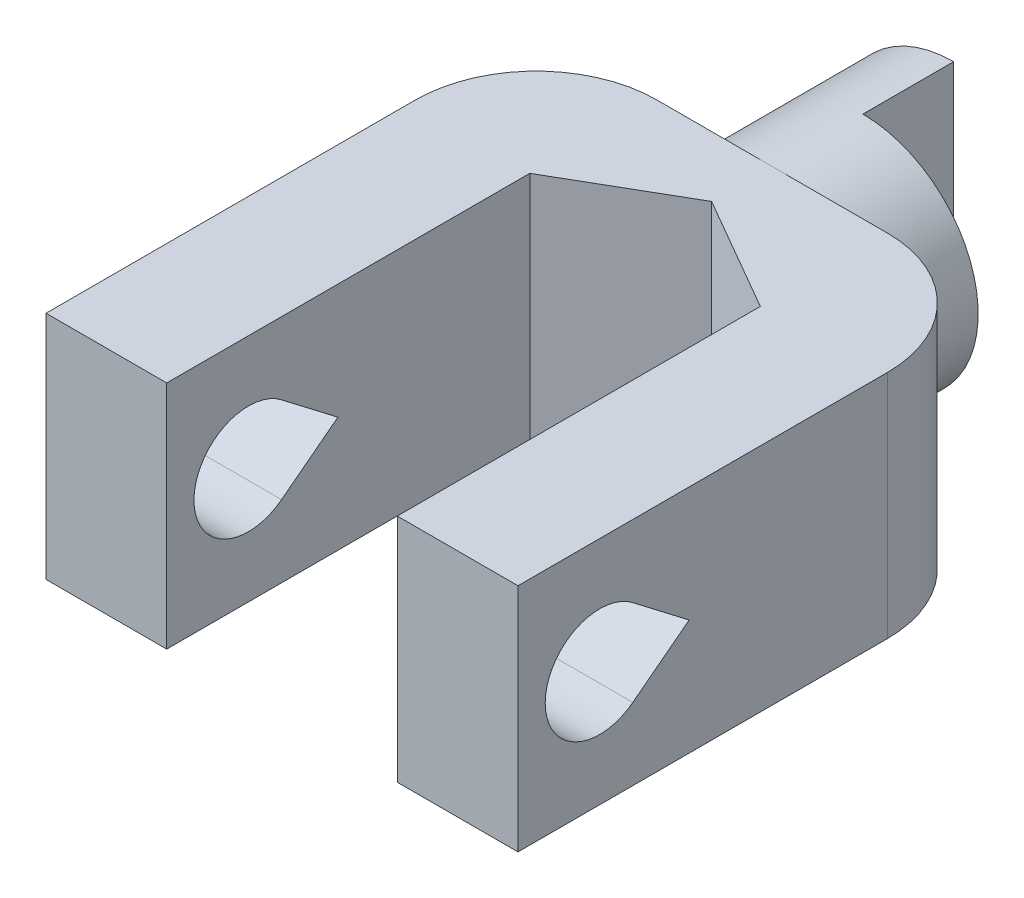
ISO-10303-21;
HEADER;
FILE_DESCRIPTION(('STEP AP214'),'2;1');
FILE_NAME('part.step','',(''),(''),'','','');
FILE_SCHEMA(('AUTOMOTIVE_DESIGN { 1 0 10303 214 1 1 1 1 }'));
ENDSEC;
DATA;
#1=APPLICATION_CONTEXT('core data for automotive mechanical design processes');
#2=APPLICATION_PROTOCOL_DEFINITION('international standard','automotive_design',2000,#1);
#3=PRODUCT_CONTEXT('',#1,'mechanical');
#4=PRODUCT('Part','Part','',(#3));
#5=PRODUCT_RELATED_PRODUCT_CATEGORY('part','',(#4));
#6=PRODUCT_DEFINITION_FORMATION('','',#4);
#7=PRODUCT_DEFINITION_CONTEXT('part definition',#1,'design');
#8=PRODUCT_DEFINITION('design','',#6,#7);
#9=PRODUCT_DEFINITION_SHAPE('','',#8);
#10=(LENGTH_UNIT() NAMED_UNIT(*) SI_UNIT(.MILLI.,.METRE.));
#11=(NAMED_UNIT(*) PLANE_ANGLE_UNIT() SI_UNIT($,.RADIAN.));
#12=(NAMED_UNIT(*) SI_UNIT($,.STERADIAN.) SOLID_ANGLE_UNIT());
#13=UNCERTAINTY_MEASURE_WITH_UNIT(LENGTH_MEASURE(1.E-05),#10,'distance_accuracy_value','');
#14=(GEOMETRIC_REPRESENTATION_CONTEXT(3) GLOBAL_UNCERTAINTY_ASSIGNED_CONTEXT((#13)) GLOBAL_UNIT_ASSIGNED_CONTEXT((#10,
#11,#12)) REPRESENTATION_CONTEXT('',''));
#15=CARTESIAN_POINT('',(0.,0.,0.));
#16=DIRECTION('',(0.,0.,1.));
#17=DIRECTION('',(1.,0.,0.));
#18=AXIS2_PLACEMENT_3D('',#15,#16,#17);
#19=CARTESIAN_POINT('',(-6.5,3.175,18.5));
#20=DIRECTION('',(0.,-1.,0.));
#21=DIRECTION('',(0.,0.,-1.));
#22=AXIS2_PLACEMENT_3D('',#19,#20,#21);
#23=PLANE('',#22);
#24=CARTESIAN_POINT('',(3.175,3.175,8.325));
#25=DIRECTION('',(0.,1.,0.));
#26=DIRECTION('',(0.,0.,1.));
#27=AXIS2_PLACEMENT_3D('',#24,#25,#26);
#28=CIRCLE('',#27,3.325);
#29=CARTESIAN_POINT('',(6.5,3.175,8.325));
#30=VERTEX_POINT('',#29);
#31=CARTESIAN_POINT('',(3.175,3.175,5.));
#32=VERTEX_POINT('',#31);
#33=EDGE_CURVE('E223',#30,#32,#28,.T.);
#34=ORIENTED_EDGE('',*,*,#33,.T.);
#35=DIRECTION('',(-1.,0.,0.));
#36=VECTOR('',#35,1.);
#37=CARTESIAN_POINT('',(-6.5,3.175,5.));
#38=LINE('',#37,#36);
#39=CARTESIAN_POINT('',(0.,3.175,5.));
#40=VERTEX_POINT('',#39);
#41=EDGE_CURVE('E302',#32,#40,#38,.T.);
#42=ORIENTED_EDGE('',*,*,#41,.T.);
#43=CARTESIAN_POINT('',(-3.175,3.175,5.));
#44=VERTEX_POINT('',#43);
#45=EDGE_CURVE('E286',#40,#44,#38,.T.);
#46=ORIENTED_EDGE('',*,*,#45,.T.);
#47=CARTESIAN_POINT('',(-3.175,3.175,8.325));
#48=DIRECTION('',(0.,-1.,0.));
#49=DIRECTION('',(0.,0.,1.));
#50=AXIS2_PLACEMENT_3D('',#47,#48,#49);
#51=CIRCLE('',#50,3.325);
#52=CARTESIAN_POINT('',(-6.5,3.175,8.325));
#53=VERTEX_POINT('',#52);
#54=EDGE_CURVE('E230',#53,#44,#51,.T.);
#55=ORIENTED_EDGE('',*,*,#54,.F.);
#56=DIRECTION('',(0.,0.,-1.));
#57=VECTOR('',#56,1.);
#58=CARTESIAN_POINT('',(-6.5,3.175,18.5));
#59=LINE('',#58,#57);
#60=CARTESIAN_POINT('',(-6.5,3.175,18.5));
#61=VERTEX_POINT('',#60);
#62=EDGE_CURVE('E312',#61,#53,#59,.T.);
#63=ORIENTED_EDGE('',*,*,#62,.F.);
#64=DIRECTION('',(-1.,0.,0.));
#65=VECTOR('',#64,1.);
#66=CARTESIAN_POINT('',(-6.5,3.175,18.5));
#67=LINE('',#66,#65);
#68=CARTESIAN_POINT('',(-3.175,3.175,18.5));
#69=VERTEX_POINT('',#68);
#70=EDGE_CURVE('E290',#69,#61,#67,.T.);
#71=ORIENTED_EDGE('',*,*,#70,.F.);
#72=DIRECTION('',(0.,0.,1.));
#73=VECTOR('',#72,1.);
#74=CARTESIAN_POINT('',(-3.175,3.175,18.5));
#75=LINE('',#74,#73);
#76=CARTESIAN_POINT('',(-3.175,3.175,8.5));
#77=VERTEX_POINT('',#76);
#78=EDGE_CURVE('E253',#77,#69,#75,.T.);
#79=ORIENTED_EDGE('',*,*,#78,.F.);
#80=DIRECTION('',(-0.866025403784438,0.,0.500000000000001));
#81=VECTOR('',#80,1.);
#82=CARTESIAN_POINT('',(-3.175,3.175,8.5));
#83=LINE('',#82,#81);
#84=CARTESIAN_POINT('',(0.,3.175,6.66691289532293));
#85=VERTEX_POINT('',#84);
#86=EDGE_CURVE('E250',#85,#77,#83,.T.);
#87=ORIENTED_EDGE('',*,*,#86,.F.);
#88=DIRECTION('',(-0.866025403784438,0.,-0.500000000000001));
#89=VECTOR('',#88,1.);
#90=CARTESIAN_POINT('',(0.,3.175,6.66691289532293));
#91=LINE('',#90,#89);
#92=CARTESIAN_POINT('',(3.175,3.175,8.5));
#93=VERTEX_POINT('',#92);
#94=EDGE_CURVE('E258',#93,#85,#91,.T.);
#95=ORIENTED_EDGE('',*,*,#94,.F.);
#96=DIRECTION('',(0.,0.,-1.));
#97=VECTOR('',#96,1.);
#98=CARTESIAN_POINT('',(3.175,3.175,8.5));
#99=LINE('',#98,#97);
#100=CARTESIAN_POINT('',(3.175,3.175,18.5));
#101=VERTEX_POINT('',#100);
#102=EDGE_CURVE('E255',#101,#93,#99,.T.);
#103=ORIENTED_EDGE('',*,*,#102,.F.);
#104=CARTESIAN_POINT('',(6.5,3.175,18.5));
#105=VERTEX_POINT('',#104);
#106=EDGE_CURVE('E292',#105,#101,#67,.T.);
#107=ORIENTED_EDGE('',*,*,#106,.F.);
#108=DIRECTION('',(0.,0.,-1.));
#109=VECTOR('',#108,1.);
#110=CARTESIAN_POINT('',(6.5,3.175,18.5));
#111=LINE('',#110,#109);
#112=EDGE_CURVE('E315',#105,#30,#111,.T.);
#113=ORIENTED_EDGE('',*,*,#112,.T.);
#114=EDGE_LOOP('',(#34,#42,#46,#55,#63,#71,#79,#87,#95,#103,#107,#113));
#115=FACE_BOUND('',#114,.T.);
#116=ADVANCED_FACE('F38',(#115),#23,.F.);
#117=CARTESIAN_POINT('',(-6.5,-3.175,18.5));
#118=DIRECTION('',(0.,1.,0.));
#119=DIRECTION('',(0.,0.,1.));
#120=AXIS2_PLACEMENT_3D('',#117,#118,#119);
#121=PLANE('',#120);
#122=CARTESIAN_POINT('',(3.175,-3.175,8.325));
#123=DIRECTION('',(0.,1.,0.));
#124=DIRECTION('',(0.,0.,1.));
#125=AXIS2_PLACEMENT_3D('',#122,#123,#124);
#126=CIRCLE('',#125,3.325);
#127=CARTESIAN_POINT('',(3.175,-3.175,5.));
#128=VERTEX_POINT('',#127);
#129=CARTESIAN_POINT('',(6.5,-3.175,8.325));
#130=VERTEX_POINT('',#129);
#131=EDGE_CURVE('E220',#128,#130,#126,.F.);
#132=ORIENTED_EDGE('',*,*,#131,.T.);
#133=DIRECTION('',(0.,0.,-1.));
#134=VECTOR('',#133,1.);
#135=CARTESIAN_POINT('',(6.5,-3.175,18.5));
#136=LINE('',#135,#134);
#137=CARTESIAN_POINT('',(6.5,-3.175,18.5));
#138=VERTEX_POINT('',#137);
#139=EDGE_CURVE('E301',#138,#130,#136,.T.);
#140=ORIENTED_EDGE('',*,*,#139,.F.);
#141=DIRECTION('',(1.,0.,0.));
#142=VECTOR('',#141,1.);
#143=CARTESIAN_POINT('',(-6.5,-3.175,18.5));
#144=LINE('',#143,#142);
#145=CARTESIAN_POINT('',(3.175,-3.175,18.5));
#146=VERTEX_POINT('',#145);
#147=EDGE_CURVE('E297',#146,#138,#144,.T.);
#148=ORIENTED_EDGE('',*,*,#147,.F.);
#149=DIRECTION('',(0.,0.,1.));
#150=VECTOR('',#149,1.);
#151=CARTESIAN_POINT('',(3.175,-3.175,8.5));
#152=LINE('',#151,#150);
#153=CARTESIAN_POINT('',(3.175,-3.175,8.5));
#154=VERTEX_POINT('',#153);
#155=EDGE_CURVE('E248',#154,#146,#152,.T.);
#156=ORIENTED_EDGE('',*,*,#155,.F.);
#157=DIRECTION('',(0.866025403784438,0.,0.500000000000001));
#158=VECTOR('',#157,1.);
#159=CARTESIAN_POINT('',(0.,-3.175,6.66691289532293));
#160=LINE('',#159,#158);
#161=CARTESIAN_POINT('',(0.,-3.175,6.66691289532293));
#162=VERTEX_POINT('',#161);
#163=EDGE_CURVE('E245',#162,#154,#160,.T.);
#164=ORIENTED_EDGE('',*,*,#163,.F.);
#165=DIRECTION('',(0.866025403784438,0.,-0.500000000000001));
#166=VECTOR('',#165,1.);
#167=CARTESIAN_POINT('',(-3.175,-3.175,8.5));
#168=LINE('',#167,#166);
#169=CARTESIAN_POINT('',(-3.175,-3.175,8.5));
#170=VERTEX_POINT('',#169);
#171=EDGE_CURVE('E242',#170,#162,#168,.T.);
#172=ORIENTED_EDGE('',*,*,#171,.F.);
#173=DIRECTION('',(0.,0.,-1.));
#174=VECTOR('',#173,1.);
#175=CARTESIAN_POINT('',(-3.175,-3.175,18.5));
#176=LINE('',#175,#174);
#177=CARTESIAN_POINT('',(-3.175,-3.175,18.5));
#178=VERTEX_POINT('',#177);
#179=EDGE_CURVE('E264',#178,#170,#176,.T.);
#180=ORIENTED_EDGE('',*,*,#179,.F.);
#181=CARTESIAN_POINT('',(-6.5,-3.175,18.5));
#182=VERTEX_POINT('',#181);
#183=EDGE_CURVE('E298',#182,#178,#144,.T.);
#184=ORIENTED_EDGE('',*,*,#183,.F.);
#185=DIRECTION('',(0.,0.,-1.));
#186=VECTOR('',#185,1.);
#187=CARTESIAN_POINT('',(-6.5,-3.175,18.5));
#188=LINE('',#187,#186);
#189=CARTESIAN_POINT('',(-6.5,-3.175,8.325));
#190=VERTEX_POINT('',#189);
#191=EDGE_CURVE('E309',#182,#190,#188,.T.);
#192=ORIENTED_EDGE('',*,*,#191,.T.);
#193=CARTESIAN_POINT('',(-3.175,-3.175,8.325));
#194=DIRECTION('',(0.,1.,0.));
#195=DIRECTION('',(0.,0.,1.));
#196=AXIS2_PLACEMENT_3D('',#193,#194,#195);
#197=CIRCLE('',#196,3.325);
#198=CARTESIAN_POINT('',(-3.175,-3.175,5.));
#199=VERTEX_POINT('',#198);
#200=EDGE_CURVE('E238',#199,#190,#197,.T.);
#201=ORIENTED_EDGE('',*,*,#200,.F.);
#202=DIRECTION('',(1.,0.,0.));
#203=VECTOR('',#202,1.);
#204=CARTESIAN_POINT('',(-6.5,-3.175,5.));
#205=LINE('',#204,#203);
#206=CARTESIAN_POINT('',(0.,-3.175,5.));
#207=VERTEX_POINT('',#206);
#208=EDGE_CURVE('E291',#199,#207,#205,.T.);
#209=ORIENTED_EDGE('',*,*,#208,.T.);
#210=EDGE_CURVE('E304',#207,#128,#205,.T.);
#211=ORIENTED_EDGE('',*,*,#210,.T.);
#212=EDGE_LOOP('',(#132,#140,#148,#156,#164,#172,#180,#184,#192,#201,#209,#211));
#213=FACE_BOUND('',#212,.T.);
#214=ADVANCED_FACE('F363',(#213),#121,.F.);
#215=CARTESIAN_POINT('',(0.,0.,5.));
#216=DIRECTION('',(0.,0.,-1.));
#217=DIRECTION('',(-1.,0.,0.));
#218=AXIS2_PLACEMENT_3D('',#215,#216,#217);
#219=PLANE('',#218);
#220=DIRECTION('',(0.,1.,0.));
#221=VECTOR('',#220,1.);
#222=CARTESIAN_POINT('',(3.175,-3.176,5.));
#223=LINE('',#222,#221);
#224=CARTESIAN_POINT('',(3.175,0.,5.));
#225=VERTEX_POINT('',#224);
#226=EDGE_CURVE('E231',#128,#225,#223,.T.);
#227=ORIENTED_EDGE('',*,*,#226,.F.);
#228=ORIENTED_EDGE('',*,*,#210,.F.);
#229=CARTESIAN_POINT('',(0.,0.,5.));
#230=DIRECTION('',(0.,0.,1.));
#231=DIRECTION('',(1.,0.,0.));
#232=AXIS2_PLACEMENT_3D('',#229,#230,#231);
#233=CIRCLE('',#232,3.175);
#234=EDGE_CURVE('E325',#207,#225,#233,.T.);
#235=ORIENTED_EDGE('',*,*,#234,.T.);
#236=EDGE_LOOP('',(#227,#228,#235));
#237=FACE_BOUND('',#236,.T.);
#238=ADVANCED_FACE('F369',(#237),#219,.T.);
#239=DIRECTION('',(0.,1.,0.));
#240=VECTOR('',#239,1.);
#241=CARTESIAN_POINT('',(-3.175,-3.176,5.));
#242=LINE('',#241,#240);
#243=CARTESIAN_POINT('',(-3.175,0.,5.));
#244=VERTEX_POINT('',#243);
#245=EDGE_CURVE('E239',#244,#44,#242,.T.);
#246=ORIENTED_EDGE('',*,*,#245,.T.);
#247=ORIENTED_EDGE('',*,*,#45,.F.);
#248=EDGE_CURVE('E319',#40,#244,#233,.T.);
#249=ORIENTED_EDGE('',*,*,#248,.T.);
#250=EDGE_LOOP('',(#246,#247,#249));
#251=FACE_BOUND('',#250,.T.);
#252=ADVANCED_FACE('F386',(#251),#219,.T.);
#253=CARTESIAN_POINT('',(0.,0.,18.5));
#254=DIRECTION('',(0.,0.,-1.));
#255=DIRECTION('',(-1.,0.,0.));
#256=AXIS2_PLACEMENT_3D('',#253,#254,#255);
#257=PLANE('',#256);
#258=ORIENTED_EDGE('',*,*,#106,.T.);
#259=DIRECTION('',(0.,1.,0.));
#260=VECTOR('',#259,1.);
#261=CARTESIAN_POINT('',(3.175,-3.176,18.5));
#262=LINE('',#261,#260);
#263=EDGE_CURVE('E267',#146,#101,#262,.T.);
#264=ORIENTED_EDGE('',*,*,#263,.F.);
#265=ORIENTED_EDGE('',*,*,#147,.T.);
#266=DIRECTION('',(0.,1.,0.));
#267=VECTOR('',#266,1.);
#268=CARTESIAN_POINT('',(6.5,-3.175,18.5));
#269=LINE('',#268,#267);
#270=EDGE_CURVE('E287',#138,#105,#269,.T.);
#271=ORIENTED_EDGE('',*,*,#270,.T.);
#272=EDGE_LOOP('',(#258,#264,#265,#271));
#273=FACE_BOUND('',#272,.T.);
#274=ADVANCED_FACE('F387',(#273),#257,.F.);
#275=CARTESIAN_POINT('',(0.,0.,5.));
#276=DIRECTION('',(0.,0.,-1.));
#277=DIRECTION('',(-1.,0.,0.));
#278=AXIS2_PLACEMENT_3D('',#275,#276,#277);
#279=CYLINDRICAL_SURFACE('',#278,3.175);
#280=ORIENTED_EDGE('',*,*,#248,.F.);
#281=EDGE_CURVE('E324',#225,#40,#233,.T.);
#282=ORIENTED_EDGE('',*,*,#281,.F.);
#283=ORIENTED_EDGE('',*,*,#234,.F.);
#284=EDGE_CURVE('E323',#244,#207,#233,.T.);
#285=ORIENTED_EDGE('',*,*,#284,.F.);
#286=EDGE_LOOP('',(#280,#282,#283,#285));
#287=FACE_BOUND('',#286,.T.);
#288=CARTESIAN_POINT('',(0.,0.,2.5));
#289=DIRECTION('',(0.,0.,1.));
#290=DIRECTION('',(1.,0.,0.));
#291=AXIS2_PLACEMENT_3D('',#288,#289,#290);
#292=CIRCLE('',#291,3.175);
#293=CARTESIAN_POINT('',(0.,3.175,2.5));
#294=VERTEX_POINT('',#293);
#295=CARTESIAN_POINT('',(0.,-3.175,2.5));
#296=VERTEX_POINT('',#295);
#297=EDGE_CURVE('E278',#294,#296,#292,.F.);
#298=ORIENTED_EDGE('',*,*,#297,.F.);
#299=DIRECTION('',(0.,0.,-1.));
#300=VECTOR('',#299,1.);
#301=CARTESIAN_POINT('',(0.,3.175,5.));
#302=LINE('',#301,#300);
#303=CARTESIAN_POINT('',(0.,3.175,0.));
#304=VERTEX_POINT('',#303);
#305=EDGE_CURVE('E275',#294,#304,#302,.T.);
#306=ORIENTED_EDGE('',*,*,#305,.T.);
#307=CARTESIAN_POINT('',(0.,0.,0.));
#308=DIRECTION('',(0.,0.,1.));
#309=DIRECTION('',(1.,0.,0.));
#310=AXIS2_PLACEMENT_3D('',#307,#308,#309);
#311=CIRCLE('',#310,3.175);
#312=CARTESIAN_POINT('',(0.,-3.175,0.));
#313=VERTEX_POINT('',#312);
#314=EDGE_CURVE('E318',#304,#313,#311,.T.);
#315=ORIENTED_EDGE('',*,*,#314,.T.);
#316=DIRECTION('',(0.,0.,-1.));
#317=VECTOR('',#316,1.);
#318=CARTESIAN_POINT('',(0.,-3.175,5.));
#319=LINE('',#318,#317);
#320=EDGE_CURVE('E279',#296,#313,#319,.T.);
#321=ORIENTED_EDGE('',*,*,#320,.F.);
#322=EDGE_LOOP('',(#298,#306,#315,#321));
#323=FACE_BOUND('',#322,.T.);
#324=ADVANCED_FACE('F40',(#287,#323),#279,.T.);
#325=CARTESIAN_POINT('',(0.,0.,0.));
#326=DIRECTION('',(0.,0.,1.));
#327=DIRECTION('',(1.,0.,0.));
#328=AXIS2_PLACEMENT_3D('',#325,#326,#327);
#329=PLANE('',#328);
#330=ORIENTED_EDGE('',*,*,#314,.F.);
#331=DIRECTION('',(0.,1.,0.));
#332=VECTOR('',#331,1.);
#333=CARTESIAN_POINT('',(0.,-3.176,0.));
#334=LINE('',#333,#332);
#335=EDGE_CURVE('E281',#313,#304,#334,.T.);
#336=ORIENTED_EDGE('',*,*,#335,.F.);
#337=EDGE_LOOP('',(#330,#336));
#338=FACE_BOUND('',#337,.T.);
#339=ADVANCED_FACE('F376',(#338),#329,.F.);
#340=EDGE_CURVE('E235',#199,#244,#242,.T.);
#341=ORIENTED_EDGE('',*,*,#340,.T.);
#342=ORIENTED_EDGE('',*,*,#284,.T.);
#343=ORIENTED_EDGE('',*,*,#208,.F.);
#344=EDGE_LOOP('',(#341,#342,#343));
#345=FACE_BOUND('',#344,.T.);
#346=ADVANCED_FACE('F375',(#345),#219,.T.);
#347=CARTESIAN_POINT('',(6.5,-3.175,18.5));
#348=DIRECTION('',(-1.,0.,0.));
#349=DIRECTION('',(0.,0.,1.));
#350=AXIS2_PLACEMENT_3D('',#347,#348,#349);
#351=PLANE('',#350);
#352=DIRECTION('',(0.,0.608761429008719,-0.793353340291236));
#353=VECTOR('',#352,1.);
#354=CARTESIAN_POINT('',(6.5,0.,13.7859805524431));
#355=LINE('',#354,#353);
#356=CARTESIAN_POINT('',(6.5,-1.19003001043685,15.3368578564869));
#357=VERTEX_POINT('',#356);
#358=CARTESIAN_POINT('',(6.5,0.,13.7859805524431));
#359=VERTEX_POINT('',#358);
#360=EDGE_CURVE('E195',#357,#359,#355,.T.);
#361=ORIENTED_EDGE('',*,*,#360,.F.);
#362=CARTESIAN_POINT('',(6.5,0.,16.25));
#363=DIRECTION('',(1.,0.,0.));
#364=DIRECTION('',(0.,0.,-1.));
#365=AXIS2_PLACEMENT_3D('',#362,#363,#364);
#366=CIRCLE('',#365,1.5);
#367=CARTESIAN_POINT('',(6.5,1.19003001043686,15.3368578564869));
#368=VERTEX_POINT('',#367);
#369=EDGE_CURVE('E53',#368,#357,#366,.T.);
#370=ORIENTED_EDGE('',*,*,#369,.F.);
#371=DIRECTION('',(0.,0.608761429008719,0.793353340291236));
#372=VECTOR('',#371,1.);
#373=CARTESIAN_POINT('',(6.5,1.19003001043686,15.3368578564869));
#374=LINE('',#373,#372);
#375=EDGE_CURVE('E187',#359,#368,#374,.T.);
#376=ORIENTED_EDGE('',*,*,#375,.F.);
#377=EDGE_LOOP('',(#361,#370,#376));
#378=FACE_BOUND('',#377,.T.);
#379=ORIENTED_EDGE('',*,*,#139,.T.);
#380=DIRECTION('',(0.,1.,0.));
#381=VECTOR('',#380,1.);
#382=CARTESIAN_POINT('',(6.5,-3.176,8.325));
#383=LINE('',#382,#381);
#384=EDGE_CURVE('E227',#130,#30,#383,.T.);
#385=ORIENTED_EDGE('',*,*,#384,.T.);
#386=ORIENTED_EDGE('',*,*,#112,.F.);
#387=ORIENTED_EDGE('',*,*,#270,.F.);
#388=EDGE_LOOP('',(#379,#385,#386,#387));
#389=FACE_BOUND('',#388,.T.);
#390=ADVANCED_FACE('F200',(#378,#389),#351,.F.);
#391=CARTESIAN_POINT('',(-6.5,-3.175,18.5));
#392=DIRECTION('',(1.,0.,0.));
#393=DIRECTION('',(0.,0.,-1.));
#394=AXIS2_PLACEMENT_3D('',#391,#392,#393);
#395=PLANE('',#394);
#396=DIRECTION('',(0.,-0.60876142900872,-0.793353340291236));
#397=VECTOR('',#396,1.);
#398=CARTESIAN_POINT('',(-6.5,1.19003001043686,15.3368578564869));
#399=LINE('',#398,#397);
#400=CARTESIAN_POINT('',(-6.5,1.19003001043686,15.3368578564869));
#401=VERTEX_POINT('',#400);
#402=CARTESIAN_POINT('',(-6.5,0.,13.7859805524431));
#403=VERTEX_POINT('',#402);
#404=EDGE_CURVE('E208',#401,#403,#399,.T.);
#405=ORIENTED_EDGE('',*,*,#404,.F.);
#406=CARTESIAN_POINT('',(-6.5,0.,16.25));
#407=DIRECTION('',(1.,0.,0.));
#408=DIRECTION('',(0.,0.,-1.));
#409=AXIS2_PLACEMENT_3D('',#406,#407,#408);
#410=CIRCLE('',#409,1.5);
#411=CARTESIAN_POINT('',(-6.5,-1.19003001043685,15.3368578564869));
#412=VERTEX_POINT('',#411);
#413=EDGE_CURVE('E214',#412,#401,#410,.F.);
#414=ORIENTED_EDGE('',*,*,#413,.F.);
#415=DIRECTION('',(0.,-0.608761429008719,0.793353340291236));
#416=VECTOR('',#415,1.);
#417=CARTESIAN_POINT('',(-6.5,0.,13.7859805524431));
#418=LINE('',#417,#416);
#419=EDGE_CURVE('E211',#403,#412,#418,.T.);
#420=ORIENTED_EDGE('',*,*,#419,.F.);
#421=EDGE_LOOP('',(#405,#414,#420));
#422=FACE_BOUND('',#421,.T.);
#423=ORIENTED_EDGE('',*,*,#62,.T.);
#424=DIRECTION('',(0.,1.,0.));
#425=VECTOR('',#424,1.);
#426=CARTESIAN_POINT('',(-6.5,-3.176,8.325));
#427=LINE('',#426,#425);
#428=EDGE_CURVE('E234',#190,#53,#427,.T.);
#429=ORIENTED_EDGE('',*,*,#428,.F.);
#430=ORIENTED_EDGE('',*,*,#191,.F.);
#431=DIRECTION('',(0.,-1.,0.));
#432=VECTOR('',#431,1.);
#433=CARTESIAN_POINT('',(-6.5,-3.175,18.5));
#434=LINE('',#433,#432);
#435=EDGE_CURVE('E295',#61,#182,#434,.T.);
#436=ORIENTED_EDGE('',*,*,#435,.F.);
#437=EDGE_LOOP('',(#423,#429,#430,#436));
#438=FACE_BOUND('',#437,.T.);
#439=ADVANCED_FACE('F346',(#422,#438),#395,.F.);
#440=ORIENTED_EDGE('',*,*,#183,.T.);
#441=DIRECTION('',(0.,1.,0.));
#442=VECTOR('',#441,1.);
#443=CARTESIAN_POINT('',(-3.175,-3.176,18.5));
#444=LINE('',#443,#442);
#445=EDGE_CURVE('E269',#178,#69,#444,.T.);
#446=ORIENTED_EDGE('',*,*,#445,.T.);
#447=ORIENTED_EDGE('',*,*,#70,.T.);
#448=ORIENTED_EDGE('',*,*,#435,.T.);
#449=EDGE_LOOP('',(#440,#446,#447,#448));
#450=FACE_BOUND('',#449,.T.);
#451=ADVANCED_FACE('F408',(#450),#257,.F.);
#452=EDGE_CURVE('E226',#225,#32,#223,.T.);
#453=ORIENTED_EDGE('',*,*,#452,.F.);
#454=ORIENTED_EDGE('',*,*,#281,.T.);
#455=ORIENTED_EDGE('',*,*,#41,.F.);
#456=EDGE_LOOP('',(#453,#454,#455));
#457=FACE_BOUND('',#456,.T.);
#458=ADVANCED_FACE('F385',(#457),#219,.T.);
#459=CARTESIAN_POINT('',(0.,-3.176,2.5));
#460=DIRECTION('',(0.,0.,1.));
#461=DIRECTION('',(1.,0.,0.));
#462=AXIS2_PLACEMENT_3D('',#459,#460,#461);
#463=PLANE('',#462);
#464=ORIENTED_EDGE('',*,*,#297,.T.);
#465=DIRECTION('',(0.,1.,0.));
#466=VECTOR('',#465,1.);
#467=CARTESIAN_POINT('',(0.,-3.176,2.5));
#468=LINE('',#467,#466);
#469=EDGE_CURVE('E284',#296,#294,#468,.T.);
#470=ORIENTED_EDGE('',*,*,#469,.T.);
#471=EDGE_LOOP('',(#464,#470));
#472=FACE_BOUND('',#471,.T.);
#473=ADVANCED_FACE('F399',(#472),#463,.F.);
#474=CARTESIAN_POINT('',(0.,-3.176,0.));
#475=DIRECTION('',(-1.,0.,0.));
#476=DIRECTION('',(0.,0.,1.));
#477=AXIS2_PLACEMENT_3D('',#474,#475,#476);
#478=PLANE('',#477);
#479=ORIENTED_EDGE('',*,*,#320,.T.);
#480=ORIENTED_EDGE('',*,*,#335,.T.);
#481=ORIENTED_EDGE('',*,*,#305,.F.);
#482=ORIENTED_EDGE('',*,*,#469,.F.);
#483=EDGE_LOOP('',(#479,#480,#481,#482));
#484=FACE_BOUND('',#483,.T.);
#485=ADVANCED_FACE('F397',(#484),#478,.F.);
#486=CARTESIAN_POINT('',(-3.175,-3.176,8.5));
#487=DIRECTION('',(-0.500000000000001,0.,-0.866025403784438));
#488=DIRECTION('',(-0.866025403784438,0.,0.500000000000001));
#489=AXIS2_PLACEMENT_3D('',#486,#487,#488);
#490=PLANE('',#489);
#491=ORIENTED_EDGE('',*,*,#171,.T.);
#492=DIRECTION('',(0.,1.,0.));
#493=VECTOR('',#492,1.);
#494=CARTESIAN_POINT('',(0.,-3.176,6.66691289532293));
#495=LINE('',#494,#493);
#496=EDGE_CURVE('E262',#162,#85,#495,.T.);
#497=ORIENTED_EDGE('',*,*,#496,.T.);
#498=ORIENTED_EDGE('',*,*,#86,.T.);
#499=DIRECTION('',(0.,1.,0.));
#500=VECTOR('',#499,1.);
#501=CARTESIAN_POINT('',(-3.175,-3.176,8.5));
#502=LINE('',#501,#500);
#503=EDGE_CURVE('E261',#170,#77,#502,.T.);
#504=ORIENTED_EDGE('',*,*,#503,.F.);
#505=EDGE_LOOP('',(#491,#497,#498,#504));
#506=FACE_BOUND('',#505,.T.);
#507=ADVANCED_FACE('F406',(#506),#490,.F.);
#508=CARTESIAN_POINT('',(0.,-3.176,6.66691289532293));
#509=DIRECTION('',(0.500000000000001,0.,-0.866025403784438));
#510=DIRECTION('',(-0.866025403784438,0.,-0.500000000000001));
#511=AXIS2_PLACEMENT_3D('',#508,#509,#510);
#512=PLANE('',#511);
#513=ORIENTED_EDGE('',*,*,#163,.T.);
#514=DIRECTION('',(0.,1.,0.));
#515=VECTOR('',#514,1.);
#516=CARTESIAN_POINT('',(3.175,-3.176,8.5));
#517=LINE('',#516,#515);
#518=EDGE_CURVE('E265',#154,#93,#517,.T.);
#519=ORIENTED_EDGE('',*,*,#518,.T.);
#520=ORIENTED_EDGE('',*,*,#94,.T.);
#521=ORIENTED_EDGE('',*,*,#496,.F.);
#522=EDGE_LOOP('',(#513,#519,#520,#521));
#523=FACE_BOUND('',#522,.T.);
#524=ADVANCED_FACE('F461',(#523),#512,.F.);
#525=CARTESIAN_POINT('',(3.175,-3.176,8.5));
#526=DIRECTION('',(1.,0.,0.));
#527=DIRECTION('',(0.,0.,-1.));
#528=AXIS2_PLACEMENT_3D('',#525,#526,#527);
#529=PLANE('',#528);
#530=DIRECTION('',(0.,0.60876142900872,0.793353340291236));
#531=VECTOR('',#530,1.);
#532=CARTESIAN_POINT('',(3.175,-3.72992792281048,8.9250438445676));
#533=LINE('',#532,#531);
#534=CARTESIAN_POINT('',(3.175,0.,13.7859805524431));
#535=VERTEX_POINT('',#534);
#536=CARTESIAN_POINT('',(3.175,1.19003001043686,15.3368578564869));
#537=VERTEX_POINT('',#536);
#538=EDGE_CURVE('E189',#535,#537,#533,.T.);
#539=ORIENTED_EDGE('',*,*,#538,.T.);
#540=CARTESIAN_POINT('',(3.175,0.,16.25));
#541=DIRECTION('',(1.,0.,0.));
#542=DIRECTION('',(0.,0.,-1.));
#543=AXIS2_PLACEMENT_3D('',#540,#541,#542);
#544=CIRCLE('',#543,1.5);
#545=CARTESIAN_POINT('',(3.175,-1.19003001043685,15.3368578564869));
#546=VERTEX_POINT('',#545);
#547=EDGE_CURVE('E217',#537,#546,#544,.T.);
#548=ORIENTED_EDGE('',*,*,#547,.T.);
#549=DIRECTION('',(0.,0.608761429008719,-0.793353340291236));
#550=VECTOR('',#549,1.);
#551=CARTESIAN_POINT('',(3.175,1.37593721005609,11.9928242688617));
#552=LINE('',#551,#550);
#553=EDGE_CURVE('E213',#546,#535,#552,.T.);
#554=ORIENTED_EDGE('',*,*,#553,.T.);
#555=EDGE_LOOP('',(#539,#548,#554));
#556=FACE_BOUND('',#555,.T.);
#557=ORIENTED_EDGE('',*,*,#155,.T.);
#558=ORIENTED_EDGE('',*,*,#263,.T.);
#559=ORIENTED_EDGE('',*,*,#102,.T.);
#560=ORIENTED_EDGE('',*,*,#518,.F.);
#561=EDGE_LOOP('',(#557,#558,#559,#560));
#562=FACE_BOUND('',#561,.T.);
#563=ADVANCED_FACE('F431',(#556,#562),#529,.F.);
#564=CARTESIAN_POINT('',(-3.175,-3.176,18.5));
#565=DIRECTION('',(-1.,0.,0.));
#566=DIRECTION('',(0.,0.,1.));
#567=AXIS2_PLACEMENT_3D('',#564,#565,#566);
#568=PLANE('',#567);
#569=DIRECTION('',(0.,-0.608761429008719,0.793353340291236));
#570=VECTOR('',#569,1.);
#571=CARTESIAN_POINT('',(-3.175,-3.45369192138925,18.2869194943743));
#572=LINE('',#571,#570);
#573=CARTESIAN_POINT('',(-3.175,0.,13.7859805524431));
#574=VERTEX_POINT('',#573);
#575=CARTESIAN_POINT('',(-3.175,-1.19003001043685,15.3368578564869));
#576=VERTEX_POINT('',#575);
#577=EDGE_CURVE('E322',#574,#576,#572,.T.);
#578=ORIENTED_EDGE('',*,*,#577,.T.);
#579=CARTESIAN_POINT('',(-3.175,0.,16.25));
#580=DIRECTION('',(-1.,0.,0.));
#581=DIRECTION('',(0.,0.,1.));
#582=AXIS2_PLACEMENT_3D('',#579,#580,#581);
#583=CIRCLE('',#582,1.5);
#584=CARTESIAN_POINT('',(-3.175,1.19003001043686,15.3368578564869));
#585=VERTEX_POINT('',#584);
#586=EDGE_CURVE('E11',#576,#585,#583,.T.);
#587=ORIENTED_EDGE('',*,*,#586,.T.);
#588=DIRECTION('',(0.,-0.60876142900872,-0.793353340291236));
#589=VECTOR('',#588,1.);
#590=CARTESIAN_POINT('',(-3.175,1.09970120863486,15.2191390700802));
#591=LINE('',#590,#589);
#592=EDGE_CURVE('E46',#585,#574,#591,.T.);
#593=ORIENTED_EDGE('',*,*,#592,.T.);
#594=EDGE_LOOP('',(#578,#587,#593));
#595=FACE_BOUND('',#594,.T.);
#596=ORIENTED_EDGE('',*,*,#179,.T.);
#597=ORIENTED_EDGE('',*,*,#503,.T.);
#598=ORIENTED_EDGE('',*,*,#78,.T.);
#599=ORIENTED_EDGE('',*,*,#445,.F.);
#600=EDGE_LOOP('',(#596,#597,#598,#599));
#601=FACE_BOUND('',#600,.T.);
#602=ADVANCED_FACE('F331',(#595,#601),#568,.F.);
#603=CARTESIAN_POINT('',(-3.175,-3.176,8.325));
#604=DIRECTION('',(0.,1.,0.));
#605=DIRECTION('',(0.,0.,1.));
#606=AXIS2_PLACEMENT_3D('',#603,#604,#605);
#607=CYLINDRICAL_SURFACE('',#606,3.325);
#608=ORIENTED_EDGE('',*,*,#200,.T.);
#609=ORIENTED_EDGE('',*,*,#428,.T.);
#610=ORIENTED_EDGE('',*,*,#54,.T.);
#611=ORIENTED_EDGE('',*,*,#245,.F.);
#612=ORIENTED_EDGE('',*,*,#340,.F.);
#613=EDGE_LOOP('',(#608,#609,#610,#611,#612));
#614=FACE_BOUND('',#613,.T.);
#615=ADVANCED_FACE('F357',(#614),#607,.T.);
#616=CARTESIAN_POINT('',(3.175,-3.176,8.325));
#617=DIRECTION('',(0.,1.,0.));
#618=DIRECTION('',(0.,0.,1.));
#619=AXIS2_PLACEMENT_3D('',#616,#617,#618);
#620=CYLINDRICAL_SURFACE('',#619,3.325);
#621=ORIENTED_EDGE('',*,*,#226,.T.);
#622=ORIENTED_EDGE('',*,*,#452,.T.);
#623=ORIENTED_EDGE('',*,*,#33,.F.);
#624=ORIENTED_EDGE('',*,*,#384,.F.);
#625=ORIENTED_EDGE('',*,*,#131,.F.);
#626=EDGE_LOOP('',(#621,#622,#623,#624,#625));
#627=FACE_BOUND('',#626,.T.);
#628=ADVANCED_FACE('F350',(#627),#620,.T.);
#629=CARTESIAN_POINT('',(-11.4712624332869,0.,13.7859805524431));
#630=DIRECTION('',(0.,-0.793353340291236,-0.608761429008719));
#631=DIRECTION('',(0.,0.608761429008719,-0.793353340291236));
#632=AXIS2_PLACEMENT_3D('',#629,#630,#631);
#633=PLANE('',#632);
#634=DIRECTION('',(1.,0.,0.));
#635=VECTOR('',#634,1.);
#636=CARTESIAN_POINT('',(-11.4712624332869,0.,13.7859805524431));
#637=LINE('',#636,#635);
#638=EDGE_CURVE('E61',#403,#574,#637,.T.);
#639=ORIENTED_EDGE('',*,*,#638,.F.);
#640=ORIENTED_EDGE('',*,*,#419,.T.);
#641=DIRECTION('',(1.,0.,0.));
#642=VECTOR('',#641,1.);
#643=CARTESIAN_POINT('',(-11.4712624332869,-1.19003001043685,15.3368578564869));
#644=LINE('',#643,#642);
#645=EDGE_CURVE('E192',#412,#576,#644,.T.);
#646=ORIENTED_EDGE('',*,*,#645,.T.);
#647=ORIENTED_EDGE('',*,*,#577,.F.);
#648=EDGE_LOOP('',(#639,#640,#646,#647));
#649=FACE_BOUND('',#648,.T.);
#650=ADVANCED_FACE('F348',(#649),#633,.F.);
#651=CARTESIAN_POINT('',(-11.4712624332869,1.19003001043686,15.3368578564869));
#652=DIRECTION('',(0.,0.793353340291236,-0.60876142900872));
#653=DIRECTION('',(0.,0.60876142900872,0.793353340291236));
#654=AXIS2_PLACEMENT_3D('',#651,#652,#653);
#655=PLANE('',#654);
#656=DIRECTION('',(1.,0.,0.));
#657=VECTOR('',#656,1.);
#658=CARTESIAN_POINT('',(-11.4712624332869,1.19003001043686,15.3368578564869));
#659=LINE('',#658,#657);
#660=EDGE_CURVE('E206',#401,#585,#659,.T.);
#661=ORIENTED_EDGE('',*,*,#660,.F.);
#662=ORIENTED_EDGE('',*,*,#404,.T.);
#663=ORIENTED_EDGE('',*,*,#638,.T.);
#664=ORIENTED_EDGE('',*,*,#592,.F.);
#665=EDGE_LOOP('',(#661,#662,#663,#664));
#666=FACE_BOUND('',#665,.T.);
#667=ADVANCED_FACE('F336',(#666),#655,.F.);
#668=CARTESIAN_POINT('',(-11.4712624332869,0.,16.25));
#669=DIRECTION('',(1.,0.,0.));
#670=DIRECTION('',(0.,0.,-1.));
#671=AXIS2_PLACEMENT_3D('',#668,#669,#670);
#672=CYLINDRICAL_SURFACE('',#671,1.5);
#673=ORIENTED_EDGE('',*,*,#645,.F.);
#674=ORIENTED_EDGE('',*,*,#413,.T.);
#675=ORIENTED_EDGE('',*,*,#660,.T.);
#676=ORIENTED_EDGE('',*,*,#586,.F.);
#677=EDGE_LOOP('',(#673,#674,#675,#676));
#678=FACE_BOUND('',#677,.T.);
#679=ADVANCED_FACE('F340',(#678),#672,.F.);
#680=EDGE_CURVE('E209',#537,#368,#659,.T.);
#681=ORIENTED_EDGE('',*,*,#680,.T.);
#682=ORIENTED_EDGE('',*,*,#369,.T.);
#683=EDGE_CURVE('E197',#546,#357,#644,.T.);
#684=ORIENTED_EDGE('',*,*,#683,.F.);
#685=ORIENTED_EDGE('',*,*,#547,.F.);
#686=EDGE_LOOP('',(#681,#682,#684,#685));
#687=FACE_BOUND('',#686,.T.);
#688=ADVANCED_FACE('F544',(#687),#672,.F.);
#689=EDGE_CURVE('E182',#535,#359,#637,.T.);
#690=ORIENTED_EDGE('',*,*,#689,.T.);
#691=ORIENTED_EDGE('',*,*,#375,.T.);
#692=ORIENTED_EDGE('',*,*,#680,.F.);
#693=ORIENTED_EDGE('',*,*,#538,.F.);
#694=EDGE_LOOP('',(#690,#691,#692,#693));
#695=FACE_BOUND('',#694,.T.);
#696=ADVANCED_FACE('F184',(#695),#655,.F.);
#697=ORIENTED_EDGE('',*,*,#683,.T.);
#698=ORIENTED_EDGE('',*,*,#360,.T.);
#699=ORIENTED_EDGE('',*,*,#689,.F.);
#700=ORIENTED_EDGE('',*,*,#553,.F.);
#701=EDGE_LOOP('',(#697,#698,#699,#700));
#702=FACE_BOUND('',#701,.T.);
#703=ADVANCED_FACE('F196',(#702),#633,.F.);
#704=CLOSED_SHELL('',(#116,#214,#238,#252,#274,#324,#339,#346,#390,#439,#451,#458,#473,#485,
#507,#524,#563,#602,#615,#628,#650,#667,#679,#688,#696,#703));
#705=MANIFOLD_SOLID_BREP('B2',#704);
#706=ADVANCED_BREP_SHAPE_REPRESENTATION('',(#18,#705),#14);
#707=SHAPE_DEFINITION_REPRESENTATION(#9,#706);
ENDSEC;
END-ISO-10303-21;
